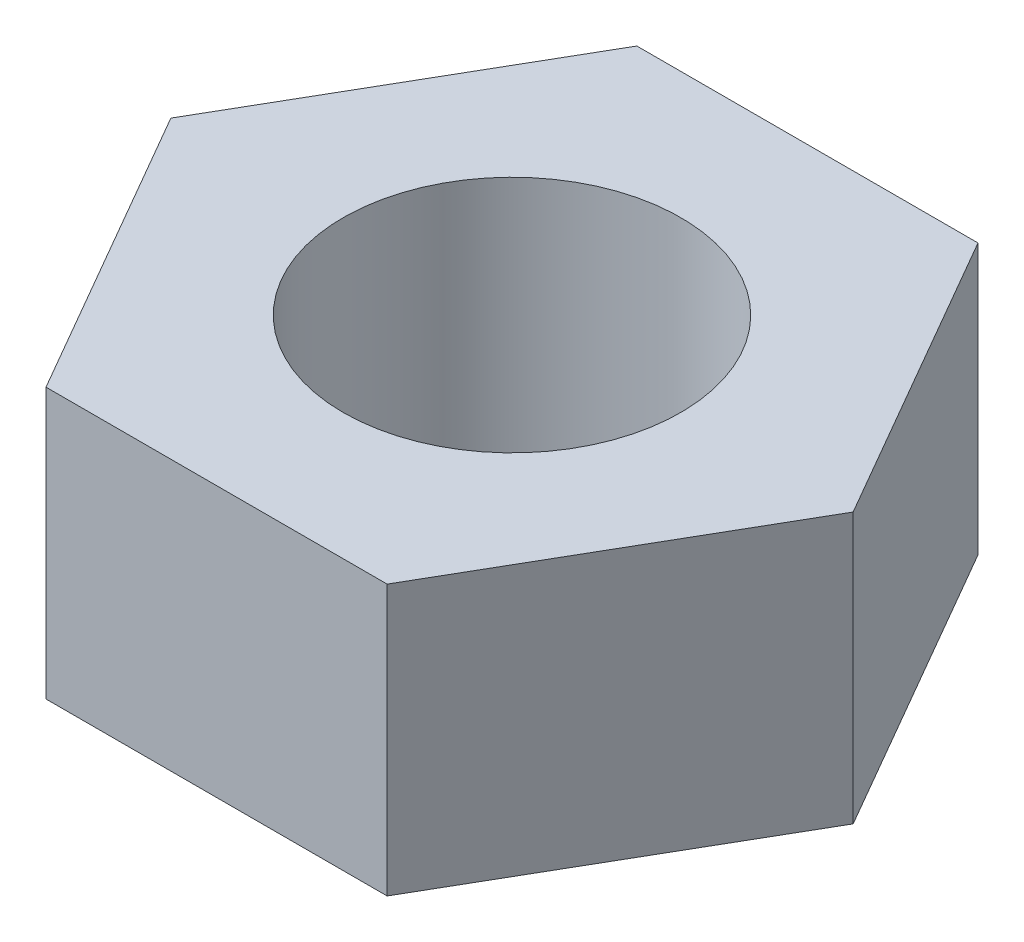
ISO-10303-21;
HEADER;
FILE_DESCRIPTION(('STEP AP214'),'2;1');
FILE_NAME('part.step','',(''),(''),'','','');
FILE_SCHEMA(('AUTOMOTIVE_DESIGN { 1 0 10303 214 1 1 1 1 }'));
ENDSEC;
DATA;
#1=APPLICATION_CONTEXT('core data for automotive mechanical design processes');
#2=APPLICATION_PROTOCOL_DEFINITION('international standard','automotive_design',2000,#1);
#3=PRODUCT_CONTEXT('',#1,'mechanical');
#4=PRODUCT('Part','Part','',(#3));
#5=PRODUCT_RELATED_PRODUCT_CATEGORY('part','',(#4));
#6=PRODUCT_DEFINITION_FORMATION('','',#4);
#7=PRODUCT_DEFINITION_CONTEXT('part definition',#1,'design');
#8=PRODUCT_DEFINITION('design','',#6,#7);
#9=PRODUCT_DEFINITION_SHAPE('','',#8);
#10=(LENGTH_UNIT() NAMED_UNIT(*) SI_UNIT(.MILLI.,.METRE.));
#11=(NAMED_UNIT(*) PLANE_ANGLE_UNIT() SI_UNIT($,.RADIAN.));
#12=(NAMED_UNIT(*) SI_UNIT($,.STERADIAN.) SOLID_ANGLE_UNIT());
#13=UNCERTAINTY_MEASURE_WITH_UNIT(LENGTH_MEASURE(1.E-05),#10,'distance_accuracy_value','');
#14=(GEOMETRIC_REPRESENTATION_CONTEXT(3) GLOBAL_UNCERTAINTY_ASSIGNED_CONTEXT((#13)) GLOBAL_UNIT_ASSIGNED_CONTEXT((#10,
#11,#12)) REPRESENTATION_CONTEXT('',''));
#15=CARTESIAN_POINT('',(0.,0.,0.));
#16=DIRECTION('',(0.,0.,1.));
#17=DIRECTION('',(1.,0.,0.));
#18=AXIS2_PLACEMENT_3D('',#15,#16,#17);
#19=CARTESIAN_POINT('',(2.02072594216369,3.2,3.5));
#20=DIRECTION('',(0.,1.,0.));
#21=DIRECTION('',(0.,0.,1.));
#22=AXIS2_PLACEMENT_3D('',#19,#20,#21);
#23=PLANE('',#22);
#24=DIRECTION('',(1.,0.,0.));
#25=VECTOR('',#24,1.);
#26=CARTESIAN_POINT('',(-2.02072594216369,3.2,3.5));
#27=LINE('',#26,#25);
#28=CARTESIAN_POINT('',(-2.02072594216369,3.2,3.5));
#29=VERTEX_POINT('',#28);
#30=CARTESIAN_POINT('',(2.02072594216369,3.2,3.5));
#31=VERTEX_POINT('',#30);
#32=EDGE_CURVE('E129',#29,#31,#27,.T.);
#33=ORIENTED_EDGE('',*,*,#32,.T.);
#34=DIRECTION('',(0.5,0.,-0.866025403784439));
#35=VECTOR('',#34,1.);
#36=CARTESIAN_POINT('',(2.02072594216369,3.2,3.5));
#37=LINE('',#36,#35);
#38=CARTESIAN_POINT('',(4.04145188432738,3.2,0.));
#39=VERTEX_POINT('',#38);
#40=EDGE_CURVE('E87',#31,#39,#37,.T.);
#41=ORIENTED_EDGE('',*,*,#40,.T.);
#42=DIRECTION('',(-0.5,0.,-0.866025403784438));
#43=VECTOR('',#42,1.);
#44=CARTESIAN_POINT('',(4.04145188432738,3.2,0.));
#45=LINE('',#44,#43);
#46=CARTESIAN_POINT('',(2.02072594216368,3.2,-3.5));
#47=VERTEX_POINT('',#46);
#48=EDGE_CURVE('E100',#39,#47,#45,.T.);
#49=ORIENTED_EDGE('',*,*,#48,.T.);
#50=DIRECTION('',(-1.,0.,0.));
#51=VECTOR('',#50,1.);
#52=CARTESIAN_POINT('',(2.02072594216368,3.2,-3.5));
#53=LINE('',#52,#51);
#54=CARTESIAN_POINT('',(-2.02072594216369,3.2,-3.5));
#55=VERTEX_POINT('',#54);
#56=EDGE_CURVE('E94',#47,#55,#53,.T.);
#57=ORIENTED_EDGE('',*,*,#56,.T.);
#58=DIRECTION('',(-0.5,0.,0.866025403784439));
#59=VECTOR('',#58,1.);
#60=CARTESIAN_POINT('',(-2.02072594216369,3.2,-3.5));
#61=LINE('',#60,#59);
#62=CARTESIAN_POINT('',(-4.04145188432738,3.2,0.));
#63=VERTEX_POINT('',#62);
#64=EDGE_CURVE('E98',#55,#63,#61,.T.);
#65=ORIENTED_EDGE('',*,*,#64,.T.);
#66=DIRECTION('',(0.5,0.,0.866025403784439));
#67=VECTOR('',#66,1.);
#68=CARTESIAN_POINT('',(-4.04145188432738,3.2,0.));
#69=LINE('',#68,#67);
#70=EDGE_CURVE('E50',#63,#29,#69,.T.);
#71=ORIENTED_EDGE('',*,*,#70,.T.);
#72=EDGE_LOOP('',(#33,#41,#49,#57,#65,#71));
#73=FACE_BOUND('',#72,.T.);
#74=CARTESIAN_POINT('',(0.,3.2,0.));
#75=DIRECTION('',(0.,1.,0.));
#76=DIRECTION('',(0.,0.,1.));
#77=AXIS2_PLACEMENT_3D('',#74,#75,#76);
#78=CIRCLE('',#77,2.);
#79=CARTESIAN_POINT('',(0.,3.2,2.));
#80=VERTEX_POINT('',#79);
#81=EDGE_CURVE('E122',#80,#80,#78,.T.);
#82=ORIENTED_EDGE('',*,*,#81,.F.);
#83=EDGE_LOOP('',(#82));
#84=FACE_BOUND('',#83,.T.);
#85=ADVANCED_FACE('F33',(#73,#84),#23,.T.);
#86=CARTESIAN_POINT('',(2.02072594216369,0.,3.5));
#87=DIRECTION('',(0.,1.,0.));
#88=DIRECTION('',(0.,0.,1.));
#89=AXIS2_PLACEMENT_3D('',#86,#87,#88);
#90=PLANE('',#89);
#91=DIRECTION('',(1.,0.,0.));
#92=VECTOR('',#91,1.);
#93=CARTESIAN_POINT('',(-2.02072594216369,0.,3.5));
#94=LINE('',#93,#92);
#95=CARTESIAN_POINT('',(-2.02072594216369,0.,3.5));
#96=VERTEX_POINT('',#95);
#97=CARTESIAN_POINT('',(2.02072594216369,0.,3.5));
#98=VERTEX_POINT('',#97);
#99=EDGE_CURVE('E118',#96,#98,#94,.T.);
#100=ORIENTED_EDGE('',*,*,#99,.F.);
#101=DIRECTION('',(0.5,0.,0.866025403784439));
#102=VECTOR('',#101,1.);
#103=CARTESIAN_POINT('',(-4.04145188432738,0.,0.));
#104=LINE('',#103,#102);
#105=CARTESIAN_POINT('',(-4.04145188432738,0.,0.));
#106=VERTEX_POINT('',#105);
#107=EDGE_CURVE('E79',#106,#96,#104,.T.);
#108=ORIENTED_EDGE('',*,*,#107,.F.);
#109=DIRECTION('',(-0.5,0.,0.866025403784439));
#110=VECTOR('',#109,1.);
#111=CARTESIAN_POINT('',(-2.02072594216369,0.,-3.5));
#112=LINE('',#111,#110);
#113=CARTESIAN_POINT('',(-2.02072594216369,0.,-3.5));
#114=VERTEX_POINT('',#113);
#115=EDGE_CURVE('E73',#114,#106,#112,.T.);
#116=ORIENTED_EDGE('',*,*,#115,.F.);
#117=DIRECTION('',(-1.,0.,0.));
#118=VECTOR('',#117,1.);
#119=CARTESIAN_POINT('',(2.02072594216368,0.,-3.5));
#120=LINE('',#119,#118);
#121=CARTESIAN_POINT('',(2.02072594216368,0.,-3.5));
#122=VERTEX_POINT('',#121);
#123=EDGE_CURVE('E108',#122,#114,#120,.T.);
#124=ORIENTED_EDGE('',*,*,#123,.F.);
#125=DIRECTION('',(-0.5,0.,-0.866025403784438));
#126=VECTOR('',#125,1.);
#127=CARTESIAN_POINT('',(4.04145188432738,0.,0.));
#128=LINE('',#127,#126);
#129=CARTESIAN_POINT('',(4.04145188432738,0.,0.));
#130=VERTEX_POINT('',#129);
#131=EDGE_CURVE('E124',#130,#122,#128,.T.);
#132=ORIENTED_EDGE('',*,*,#131,.F.);
#133=DIRECTION('',(0.5,0.,-0.866025403784439));
#134=VECTOR('',#133,1.);
#135=CARTESIAN_POINT('',(2.02072594216369,0.,3.5));
#136=LINE('',#135,#134);
#137=EDGE_CURVE('E121',#98,#130,#136,.T.);
#138=ORIENTED_EDGE('',*,*,#137,.F.);
#139=EDGE_LOOP('',(#100,#108,#116,#124,#132,#138));
#140=FACE_BOUND('',#139,.T.);
#141=CARTESIAN_POINT('',(0.,0.,0.));
#142=DIRECTION('',(0.,1.,0.));
#143=DIRECTION('',(0.,0.,1.));
#144=AXIS2_PLACEMENT_3D('',#141,#142,#143);
#145=CIRCLE('',#144,2.);
#146=CARTESIAN_POINT('',(0.,0.,2.));
#147=VERTEX_POINT('',#146);
#148=EDGE_CURVE('E222',#147,#147,#145,.T.);
#149=ORIENTED_EDGE('',*,*,#148,.T.);
#150=EDGE_LOOP('',(#149));
#151=FACE_BOUND('',#150,.T.);
#152=ADVANCED_FACE('F138',(#140,#151),#90,.F.);
#153=CARTESIAN_POINT('',(-2.02072594216369,3.2,3.5));
#154=DIRECTION('',(0.,0.,-1.));
#155=DIRECTION('',(-1.,0.,0.));
#156=AXIS2_PLACEMENT_3D('',#153,#154,#155);
#157=PLANE('',#156);
#158=ORIENTED_EDGE('',*,*,#99,.T.);
#159=DIRECTION('',(0.,-1.,0.));
#160=VECTOR('',#159,1.);
#161=CARTESIAN_POINT('',(2.02072594216369,3.2,3.5));
#162=LINE('',#161,#160);
#163=EDGE_CURVE('E11',#31,#98,#162,.T.);
#164=ORIENTED_EDGE('',*,*,#163,.F.);
#165=ORIENTED_EDGE('',*,*,#32,.F.);
#166=DIRECTION('',(0.,-1.,0.));
#167=VECTOR('',#166,1.);
#168=CARTESIAN_POINT('',(-2.02072594216369,3.2,3.5));
#169=LINE('',#168,#167);
#170=EDGE_CURVE('E114',#29,#96,#169,.T.);
#171=ORIENTED_EDGE('',*,*,#170,.T.);
#172=EDGE_LOOP('',(#158,#164,#165,#171));
#173=FACE_BOUND('',#172,.T.);
#174=ADVANCED_FACE('F35',(#173),#157,.F.);
#175=CARTESIAN_POINT('',(2.02072594216369,3.2,3.5));
#176=DIRECTION('',(-0.866025403784439,0.,-0.5));
#177=DIRECTION('',(-0.5,0.,0.866025403784439));
#178=AXIS2_PLACEMENT_3D('',#175,#176,#177);
#179=PLANE('',#178);
#180=ORIENTED_EDGE('',*,*,#137,.T.);
#181=DIRECTION('',(0.,-1.,0.));
#182=VECTOR('',#181,1.);
#183=CARTESIAN_POINT('',(4.04145188432738,3.2,0.));
#184=LINE('',#183,#182);
#185=EDGE_CURVE('E42',#39,#130,#184,.T.);
#186=ORIENTED_EDGE('',*,*,#185,.F.);
#187=ORIENTED_EDGE('',*,*,#40,.F.);
#188=ORIENTED_EDGE('',*,*,#163,.T.);
#189=EDGE_LOOP('',(#180,#186,#187,#188));
#190=FACE_BOUND('',#189,.T.);
#191=ADVANCED_FACE('F163',(#190),#179,.F.);
#192=CARTESIAN_POINT('',(4.04145188432738,3.2,0.));
#193=DIRECTION('',(-0.866025403784438,0.,0.5));
#194=DIRECTION('',(0.5,0.,0.866025403784439));
#195=AXIS2_PLACEMENT_3D('',#192,#193,#194);
#196=PLANE('',#195);
#197=ORIENTED_EDGE('',*,*,#131,.T.);
#198=DIRECTION('',(0.,-1.,0.));
#199=VECTOR('',#198,1.);
#200=CARTESIAN_POINT('',(2.02072594216368,3.2,-3.5));
#201=LINE('',#200,#199);
#202=EDGE_CURVE('E109',#47,#122,#201,.T.);
#203=ORIENTED_EDGE('',*,*,#202,.F.);
#204=ORIENTED_EDGE('',*,*,#48,.F.);
#205=ORIENTED_EDGE('',*,*,#185,.T.);
#206=EDGE_LOOP('',(#197,#203,#204,#205));
#207=FACE_BOUND('',#206,.T.);
#208=ADVANCED_FACE('F135',(#207),#196,.F.);
#209=CARTESIAN_POINT('',(2.02072594216368,3.2,-3.5));
#210=DIRECTION('',(0.,0.,1.));
#211=DIRECTION('',(1.,0.,0.));
#212=AXIS2_PLACEMENT_3D('',#209,#210,#211);
#213=PLANE('',#212);
#214=ORIENTED_EDGE('',*,*,#123,.T.);
#215=DIRECTION('',(0.,-1.,0.));
#216=VECTOR('',#215,1.);
#217=CARTESIAN_POINT('',(-2.02072594216369,3.2,-3.5));
#218=LINE('',#217,#216);
#219=EDGE_CURVE('E105',#55,#114,#218,.T.);
#220=ORIENTED_EDGE('',*,*,#219,.F.);
#221=ORIENTED_EDGE('',*,*,#56,.F.);
#222=ORIENTED_EDGE('',*,*,#202,.T.);
#223=EDGE_LOOP('',(#214,#220,#221,#222));
#224=FACE_BOUND('',#223,.T.);
#225=ADVANCED_FACE('F106',(#224),#213,.F.);
#226=CARTESIAN_POINT('',(-2.02072594216369,3.2,-3.5));
#227=DIRECTION('',(0.866025403784439,0.,0.5));
#228=DIRECTION('',(0.5,0.,-0.866025403784439));
#229=AXIS2_PLACEMENT_3D('',#226,#227,#228);
#230=PLANE('',#229);
#231=ORIENTED_EDGE('',*,*,#115,.T.);
#232=DIRECTION('',(0.,-1.,0.));
#233=VECTOR('',#232,1.);
#234=CARTESIAN_POINT('',(-4.04145188432738,3.2,0.));
#235=LINE('',#234,#233);
#236=EDGE_CURVE('E110',#63,#106,#235,.T.);
#237=ORIENTED_EDGE('',*,*,#236,.F.);
#238=ORIENTED_EDGE('',*,*,#64,.F.);
#239=ORIENTED_EDGE('',*,*,#219,.T.);
#240=EDGE_LOOP('',(#231,#237,#238,#239));
#241=FACE_BOUND('',#240,.T.);
#242=ADVANCED_FACE('F112',(#241),#230,.F.);
#243=CARTESIAN_POINT('',(-4.04145188432738,3.2,0.));
#244=DIRECTION('',(0.866025403784439,0.,-0.5));
#245=DIRECTION('',(-0.5,0.,-0.866025403784439));
#246=AXIS2_PLACEMENT_3D('',#243,#244,#245);
#247=PLANE('',#246);
#248=ORIENTED_EDGE('',*,*,#107,.T.);
#249=ORIENTED_EDGE('',*,*,#170,.F.);
#250=ORIENTED_EDGE('',*,*,#70,.F.);
#251=ORIENTED_EDGE('',*,*,#236,.T.);
#252=EDGE_LOOP('',(#248,#249,#250,#251));
#253=FACE_BOUND('',#252,.T.);
#254=ADVANCED_FACE('F143',(#253),#247,.F.);
#255=CARTESIAN_POINT('',(0.,3.2,0.));
#256=DIRECTION('',(0.,-1.,0.));
#257=DIRECTION('',(0.,0.,-1.));
#258=AXIS2_PLACEMENT_3D('',#255,#256,#257);
#259=CYLINDRICAL_SURFACE('',#258,2.);
#260=ORIENTED_EDGE('',*,*,#81,.T.);
#261=EDGE_LOOP('',(#260));
#262=FACE_BOUND('',#261,.T.);
#263=ORIENTED_EDGE('',*,*,#148,.F.);
#264=EDGE_LOOP('',(#263));
#265=FACE_BOUND('',#264,.T.);
#266=ADVANCED_FACE('F145',(#262,#265),#259,.F.);
#267=CLOSED_SHELL('',(#85,#152,#174,#191,#208,#225,#242,#254,#266));
#268=MANIFOLD_SOLID_BREP('B2',#267);
#269=ADVANCED_BREP_SHAPE_REPRESENTATION('',(#18,#268),#14);
#270=SHAPE_DEFINITION_REPRESENTATION(#9,#269);
ENDSEC;
END-ISO-10303-21;
